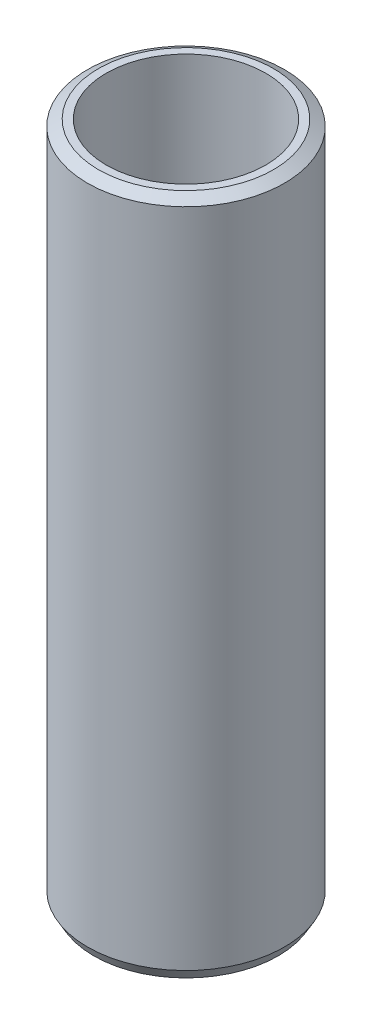
ISO-10303-21;
HEADER;
FILE_DESCRIPTION(('STEP AP214'),'2;1');
FILE_NAME('part.step','',(''),(''),'','','');
FILE_SCHEMA(('AUTOMOTIVE_DESIGN { 1 0 10303 214 1 1 1 1 }'));
ENDSEC;
DATA;
#1=APPLICATION_CONTEXT('core data for automotive mechanical design processes');
#2=APPLICATION_PROTOCOL_DEFINITION('international standard','automotive_design',2000,#1);
#3=PRODUCT_CONTEXT('',#1,'mechanical');
#4=PRODUCT('Part','Part','',(#3));
#5=PRODUCT_RELATED_PRODUCT_CATEGORY('part','',(#4));
#6=PRODUCT_DEFINITION_FORMATION('','',#4);
#7=PRODUCT_DEFINITION_CONTEXT('part definition',#1,'design');
#8=PRODUCT_DEFINITION('design','',#6,#7);
#9=PRODUCT_DEFINITION_SHAPE('','',#8);
#10=(LENGTH_UNIT() NAMED_UNIT(*) SI_UNIT(.MILLI.,.METRE.));
#11=(NAMED_UNIT(*) PLANE_ANGLE_UNIT() SI_UNIT($,.RADIAN.));
#12=(NAMED_UNIT(*) SI_UNIT($,.STERADIAN.) SOLID_ANGLE_UNIT());
#13=UNCERTAINTY_MEASURE_WITH_UNIT(LENGTH_MEASURE(1.E-05),#10,'distance_accuracy_value','');
#14=(GEOMETRIC_REPRESENTATION_CONTEXT(3) GLOBAL_UNCERTAINTY_ASSIGNED_CONTEXT((#13)) GLOBAL_UNIT_ASSIGNED_CONTEXT((#10,
#11,#12)) REPRESENTATION_CONTEXT('',''));
#15=CARTESIAN_POINT('',(0.,0.,0.));
#16=DIRECTION('',(0.,0.,1.));
#17=DIRECTION('',(1.,0.,0.));
#18=AXIS2_PLACEMENT_3D('',#15,#16,#17);
#19=CARTESIAN_POINT('',(0.,396.21103937211,0.));
#20=DIRECTION('',(0.,-1.,0.));
#21=DIRECTION('',(0.,0.,-1.));
#22=AXIS2_PLACEMENT_3D('',#19,#20,#21);
#23=CYLINDRICAL_SURFACE('',#22,57.5);
#24=CARTESIAN_POINT('',(0.,392.536244253895,0.));
#25=DIRECTION('',(0.,1.,0.));
#26=DIRECTION('',(0.,0.,1.));
#27=AXIS2_PLACEMENT_3D('',#24,#25,#26);
#28=CIRCLE('',#27,57.5);
#29=CARTESIAN_POINT('',(0.,392.536244253895,57.5));
#30=VERTEX_POINT('',#29);
#31=EDGE_CURVE('E50',#30,#30,#28,.F.);
#32=ORIENTED_EDGE('',*,*,#31,.T.);
#33=EDGE_LOOP('',(#32));
#34=FACE_BOUND('',#33,.T.);
#35=CARTESIAN_POINT('',(0.,6.36493185215359,0.));
#36=DIRECTION('',(0.,1.,0.));
#37=DIRECTION('',(0.,0.,1.));
#38=AXIS2_PLACEMENT_3D('',#35,#36,#37);
#39=CIRCLE('',#38,57.5);
#40=CARTESIAN_POINT('',(0.,6.36493185215359,57.5));
#41=VERTEX_POINT('',#40);
#42=EDGE_CURVE('E51',#41,#41,#39,.T.);
#43=ORIENTED_EDGE('',*,*,#42,.T.);
#44=EDGE_LOOP('',(#43));
#45=FACE_BOUND('',#44,.T.);
#46=ADVANCED_FACE('F39',(#34,#45),#23,.T.);
#47=CARTESIAN_POINT('',(0.,396.21103937211,0.));
#48=DIRECTION('',(0.,1.,0.));
#49=DIRECTION('',(0.,0.,1.));
#50=AXIS2_PLACEMENT_3D('',#47,#48,#49);
#51=PLANE('',#50);
#52=CARTESIAN_POINT('',(0.,396.21103937211,0.));
#53=DIRECTION('',(0.,1.,0.));
#54=DIRECTION('',(0.,0.,1.));
#55=AXIS2_PLACEMENT_3D('',#52,#53,#54);
#56=CIRCLE('',#55,51.1350681478463);
#57=CARTESIAN_POINT('',(0.,396.21103937211,51.1350681478463));
#58=VERTEX_POINT('',#57);
#59=EDGE_CURVE('E54',#58,#58,#56,.T.);
#60=ORIENTED_EDGE('',*,*,#59,.T.);
#61=EDGE_LOOP('',(#60));
#62=FACE_BOUND('',#61,.T.);
#63=CARTESIAN_POINT('',(0.,396.21103937211,0.));
#64=DIRECTION('',(0.,1.,0.));
#65=DIRECTION('',(0.,0.,1.));
#66=AXIS2_PLACEMENT_3D('',#63,#64,#65);
#67=CIRCLE('',#66,46.5401565313858);
#68=CARTESIAN_POINT('',(0.,396.21103937211,46.5401565313858));
#69=VERTEX_POINT('',#68);
#70=EDGE_CURVE('E58',#69,#69,#67,.T.);
#71=ORIENTED_EDGE('',*,*,#70,.F.);
#72=EDGE_LOOP('',(#71));
#73=FACE_BOUND('',#72,.T.);
#74=ADVANCED_FACE('F69',(#62,#73),#51,.T.);
#75=CARTESIAN_POINT('',(0.,0.,0.));
#76=DIRECTION('',(0.,1.,0.));
#77=DIRECTION('',(0.,0.,1.));
#78=AXIS2_PLACEMENT_3D('',#75,#76,#77);
#79=PLANE('',#78);
#80=CARTESIAN_POINT('',(0.,0.,0.));
#81=DIRECTION('',(0.,1.,0.));
#82=DIRECTION('',(0.,0.,1.));
#83=AXIS2_PLACEMENT_3D('',#80,#81,#82);
#84=CIRCLE('',#83,53.8252048817855);
#85=CARTESIAN_POINT('',(0.,0.,53.8252048817855));
#86=VERTEX_POINT('',#85);
#87=EDGE_CURVE('E10',#86,#86,#84,.F.);
#88=ORIENTED_EDGE('',*,*,#87,.T.);
#89=EDGE_LOOP('',(#88));
#90=FACE_BOUND('',#89,.T.);
#91=CARTESIAN_POINT('',(0.,0.,0.));
#92=DIRECTION('',(0.,1.,0.));
#93=DIRECTION('',(0.,0.,1.));
#94=AXIS2_PLACEMENT_3D('',#91,#92,#93);
#95=CIRCLE('',#94,46.5401565313858);
#96=CARTESIAN_POINT('',(0.,0.,46.5401565313858));
#97=VERTEX_POINT('',#96);
#98=EDGE_CURVE('E63',#97,#97,#95,.T.);
#99=ORIENTED_EDGE('',*,*,#98,.T.);
#100=EDGE_LOOP('',(#99));
#101=FACE_BOUND('',#100,.T.);
#102=ADVANCED_FACE('F75',(#90,#101),#79,.F.);
#103=CARTESIAN_POINT('',(0.,396.21103937211,0.));
#104=DIRECTION('',(0.,-1.,0.));
#105=DIRECTION('',(0.,0.,-1.));
#106=AXIS2_PLACEMENT_3D('',#103,#104,#105);
#107=CYLINDRICAL_SURFACE('',#106,46.5401565313858);
#108=ORIENTED_EDGE('',*,*,#70,.T.);
#109=EDGE_LOOP('',(#108));
#110=FACE_BOUND('',#109,.T.);
#111=ORIENTED_EDGE('',*,*,#98,.F.);
#112=EDGE_LOOP('',(#111));
#113=FACE_BOUND('',#112,.T.);
#114=ADVANCED_FACE('F70',(#110,#113),#107,.F.);
#115=CARTESIAN_POINT('',(0.,396.21103937211,0.));
#116=DIRECTION('',(0.,-1.,0.));
#117=DIRECTION('',(0.,0.,-1.));
#118=AXIS2_PLACEMENT_3D('',#115,#116,#117);
#119=CONICAL_SURFACE('',#118,51.1350681478463,1.0471975511966);
#120=ORIENTED_EDGE('',*,*,#31,.F.);
#121=EDGE_LOOP('',(#120));
#122=FACE_BOUND('',#121,.T.);
#123=ORIENTED_EDGE('',*,*,#59,.F.);
#124=EDGE_LOOP('',(#123));
#125=FACE_BOUND('',#124,.T.);
#126=ADVANCED_FACE('F81',(#122,#125),#119,.T.);
#127=CARTESIAN_POINT('',(0.,6.36493185215359,0.));
#128=DIRECTION('',(0.,1.,0.));
#129=DIRECTION('',(0.,0.,1.));
#130=AXIS2_PLACEMENT_3D('',#127,#128,#129);
#131=CONICAL_SURFACE('',#130,57.5,0.523598775598304);
#132=ORIENTED_EDGE('',*,*,#87,.F.);
#133=EDGE_LOOP('',(#132));
#134=FACE_BOUND('',#133,.T.);
#135=ORIENTED_EDGE('',*,*,#42,.F.);
#136=EDGE_LOOP('',(#135));
#137=FACE_BOUND('',#136,.T.);
#138=ADVANCED_FACE('F45',(#134,#137),#131,.T.);
#139=CLOSED_SHELL('',(#46,#74,#102,#114,#126,#138));
#140=MANIFOLD_SOLID_BREP('B2',#139);
#141=ADVANCED_BREP_SHAPE_REPRESENTATION('',(#18,#140),#14);
#142=SHAPE_DEFINITION_REPRESENTATION(#9,#141);
ENDSEC;
END-ISO-10303-21;
